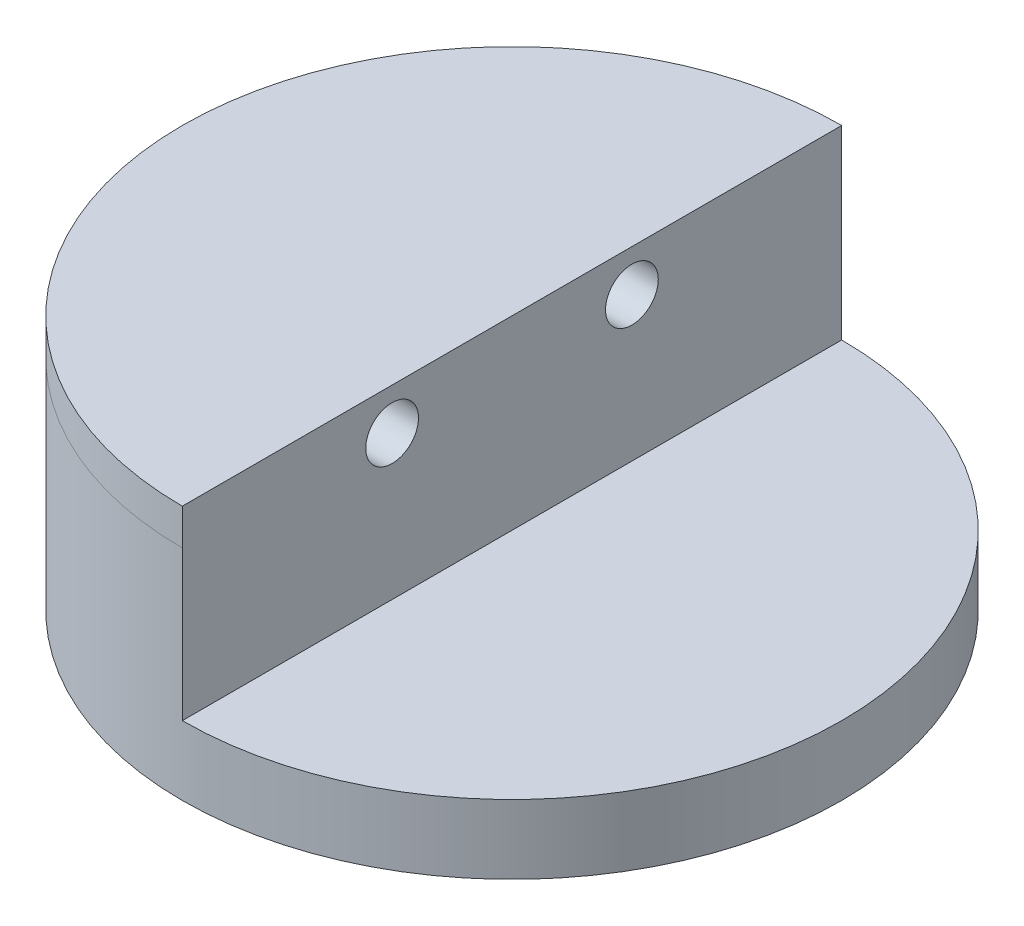
ISO-10303-21;
HEADER;
FILE_DESCRIPTION(('STEP AP214'),'2;1');
FILE_NAME('part.step','',(''),(''),'','','');
FILE_SCHEMA(('AUTOMOTIVE_DESIGN { 1 0 10303 214 1 1 1 1 }'));
ENDSEC;
DATA;
#1=APPLICATION_CONTEXT('core data for automotive mechanical design processes');
#2=APPLICATION_PROTOCOL_DEFINITION('international standard','automotive_design',2000,#1);
#3=PRODUCT_CONTEXT('',#1,'mechanical');
#4=PRODUCT('Part','Part','',(#3));
#5=PRODUCT_RELATED_PRODUCT_CATEGORY('part','',(#4));
#6=PRODUCT_DEFINITION_FORMATION('','',#4);
#7=PRODUCT_DEFINITION_CONTEXT('part definition',#1,'design');
#8=PRODUCT_DEFINITION('design','',#6,#7);
#9=PRODUCT_DEFINITION_SHAPE('','',#8);
#10=(LENGTH_UNIT() NAMED_UNIT(*) SI_UNIT(.MILLI.,.METRE.));
#11=(NAMED_UNIT(*) PLANE_ANGLE_UNIT() SI_UNIT($,.RADIAN.));
#12=(NAMED_UNIT(*) SI_UNIT($,.STERADIAN.) SOLID_ANGLE_UNIT());
#13=UNCERTAINTY_MEASURE_WITH_UNIT(LENGTH_MEASURE(1.E-05),#10,'distance_accuracy_value','');
#14=(GEOMETRIC_REPRESENTATION_CONTEXT(3) GLOBAL_UNCERTAINTY_ASSIGNED_CONTEXT((#13)) GLOBAL_UNIT_ASSIGNED_CONTEXT((#10,
#11,#12)) REPRESENTATION_CONTEXT('',''));
#15=CARTESIAN_POINT('',(0.,0.,0.));
#16=DIRECTION('',(0.,0.,1.));
#17=DIRECTION('',(1.,0.,0.));
#18=AXIS2_PLACEMENT_3D('',#15,#16,#17);
#19=CARTESIAN_POINT('',(0.,35.,0.));
#20=DIRECTION('',(0.,-1.,0.));
#21=DIRECTION('',(0.,0.,-1.));
#22=AXIS2_PLACEMENT_3D('',#19,#20,#21);
#23=CYLINDRICAL_SURFACE('',#22,55.);
#24=CARTESIAN_POINT('',(0.,0.,0.));
#25=DIRECTION('',(0.,1.,0.));
#26=DIRECTION('',(0.,0.,1.));
#27=AXIS2_PLACEMENT_3D('',#24,#25,#26);
#28=CIRCLE('',#27,55.);
#29=CARTESIAN_POINT('',(0.,0.,55.));
#30=VERTEX_POINT('',#29);
#31=EDGE_CURVE('E133',#30,#30,#28,.T.);
#32=ORIENTED_EDGE('',*,*,#31,.T.);
#33=EDGE_LOOP('',(#32));
#34=FACE_BOUND('',#33,.T.);
#35=DIRECTION('',(0.,-1.,0.));
#36=VECTOR('',#35,1.);
#37=CARTESIAN_POINT('',(0.,42.5292929936542,55.));
#38=LINE('',#37,#36);
#39=CARTESIAN_POINT('',(0.,36.497177088495,55.));
#40=VERTEX_POINT('',#39);
#41=CARTESIAN_POINT('',(0.,11.5375695683537,55.));
#42=VERTEX_POINT('',#41);
#43=EDGE_CURVE('E109',#40,#42,#38,.T.);
#44=ORIENTED_EDGE('',*,*,#43,.F.);
#45=CARTESIAN_POINT('',(0.,36.497177088495,0.));
#46=DIRECTION('',(0.,1.,0.));
#47=DIRECTION('',(0.,0.,1.));
#48=AXIS2_PLACEMENT_3D('',#45,#46,#47);
#49=CIRCLE('',#48,55.);
#50=CARTESIAN_POINT('',(0.,36.497177088495,-55.));
#51=VERTEX_POINT('',#50);
#52=EDGE_CURVE('E120',#51,#40,#49,.T.);
#53=ORIENTED_EDGE('',*,*,#52,.F.);
#54=DIRECTION('',(0.,1.,0.));
#55=VECTOR('',#54,1.);
#56=CARTESIAN_POINT('',(0.,42.5292929936542,-55.));
#57=LINE('',#56,#55);
#58=CARTESIAN_POINT('',(0.,11.5375695683537,-55.));
#59=VERTEX_POINT('',#58);
#60=EDGE_CURVE('E67',#59,#51,#57,.T.);
#61=ORIENTED_EDGE('',*,*,#60,.F.);
#62=CARTESIAN_POINT('',(0.,11.5375695683537,0.));
#63=DIRECTION('',(0.,1.,0.));
#64=DIRECTION('',(0.,0.,1.));
#65=AXIS2_PLACEMENT_3D('',#62,#63,#64);
#66=CIRCLE('',#65,55.);
#67=EDGE_CURVE('E11',#42,#59,#66,.T.);
#68=ORIENTED_EDGE('',*,*,#67,.F.);
#69=EDGE_LOOP('',(#44,#53,#61,#68));
#70=FACE_BOUND('',#69,.T.);
#71=ADVANCED_FACE('F46',(#34,#70),#23,.T.);
#72=CARTESIAN_POINT('',(0.,42.5292929936542,0.));
#73=DIRECTION('',(0.,1.,0.));
#74=DIRECTION('',(0.,0.,1.));
#75=AXIS2_PLACEMENT_3D('',#72,#73,#74);
#76=PLANE('',#75);
#77=CARTESIAN_POINT('',(0.,42.5292929936542,0.));
#78=DIRECTION('',(0.,1.,0.));
#79=DIRECTION('',(0.,0.,1.));
#80=AXIS2_PLACEMENT_3D('',#77,#78,#79);
#81=CIRCLE('',#80,55.);
#82=CARTESIAN_POINT('',(0.,42.5292929936542,-55.));
#83=VERTEX_POINT('',#82);
#84=CARTESIAN_POINT('',(0.,42.5292929936542,55.));
#85=VERTEX_POINT('',#84);
#86=EDGE_CURVE('E124',#83,#85,#81,.T.);
#87=ORIENTED_EDGE('',*,*,#86,.T.);
#88=DIRECTION('',(0.,0.,1.));
#89=VECTOR('',#88,1.);
#90=CARTESIAN_POINT('',(0.,42.5292929936542,55.));
#91=LINE('',#90,#89);
#92=EDGE_CURVE('E61',#83,#85,#91,.T.);
#93=ORIENTED_EDGE('',*,*,#92,.F.);
#94=EDGE_LOOP('',(#87,#93));
#95=FACE_BOUND('',#94,.T.);
#96=ADVANCED_FACE('F168',(#95),#76,.T.);
#97=CARTESIAN_POINT('',(0.,36.497177088495,0.));
#98=DIRECTION('',(0.,1.,0.));
#99=DIRECTION('',(0.,0.,1.));
#100=AXIS2_PLACEMENT_3D('',#97,#98,#99);
#101=CYLINDRICAL_SURFACE('',#100,55.);
#102=ORIENTED_EDGE('',*,*,#86,.F.);
#103=DIRECTION('',(0.,1.,0.));
#104=VECTOR('',#103,1.);
#105=CARTESIAN_POINT('',(0.,36.497177088495,-55.));
#106=LINE('',#105,#104);
#107=EDGE_CURVE('E54',#83,#51,#106,.F.);
#108=ORIENTED_EDGE('',*,*,#107,.T.);
#109=ORIENTED_EDGE('',*,*,#52,.T.);
#110=EDGE_CURVE('E110',#85,#40,#38,.T.);
#111=ORIENTED_EDGE('',*,*,#110,.F.);
#112=EDGE_LOOP('',(#102,#108,#109,#111));
#113=FACE_BOUND('',#112,.T.);
#114=ADVANCED_FACE('F143',(#113),#101,.T.);
#115=CARTESIAN_POINT('',(0.,0.,0.));
#116=DIRECTION('',(0.,1.,0.));
#117=DIRECTION('',(0.,0.,1.));
#118=AXIS2_PLACEMENT_3D('',#115,#116,#117);
#119=PLANE('',#118);
#120=CARTESIAN_POINT('',(0.,0.,0.));
#121=DIRECTION('',(0.,-1.,0.));
#122=DIRECTION('',(0.,0.,-1.));
#123=AXIS2_PLACEMENT_3D('',#120,#121,#122);
#124=CIRCLE('',#123,28.);
#125=CARTESIAN_POINT('',(0.,0.,-28.));
#126=VERTEX_POINT('',#125);
#127=EDGE_CURVE('E128',#126,#126,#124,.T.);
#128=ORIENTED_EDGE('',*,*,#127,.F.);
#129=EDGE_LOOP('',(#128));
#130=FACE_BOUND('',#129,.T.);
#131=ORIENTED_EDGE('',*,*,#31,.F.);
#132=EDGE_LOOP('',(#131));
#133=FACE_BOUND('',#132,.T.);
#134=ADVANCED_FACE('F177',(#130,#133),#119,.F.);
#135=CARTESIAN_POINT('',(0.,10.,0.));
#136=DIRECTION('',(0.,-1.,0.));
#137=DIRECTION('',(0.,0.,-1.));
#138=AXIS2_PLACEMENT_3D('',#135,#136,#137);
#139=CYLINDRICAL_SURFACE('',#138,28.);
#140=CARTESIAN_POINT('',(0.,10.,0.));
#141=DIRECTION('',(0.,-1.,0.));
#142=DIRECTION('',(0.,0.,-1.));
#143=AXIS2_PLACEMENT_3D('',#140,#141,#142);
#144=CIRCLE('',#143,28.);
#145=CARTESIAN_POINT('',(0.,10.,-28.));
#146=VERTEX_POINT('',#145);
#147=EDGE_CURVE('E129',#146,#146,#144,.T.);
#148=ORIENTED_EDGE('',*,*,#147,.F.);
#149=EDGE_LOOP('',(#148));
#150=FACE_BOUND('',#149,.T.);
#151=ORIENTED_EDGE('',*,*,#127,.T.);
#152=EDGE_LOOP('',(#151));
#153=FACE_BOUND('',#152,.T.);
#154=ADVANCED_FACE('F163',(#150,#153),#139,.F.);
#155=CARTESIAN_POINT('',(0.,10.,0.));
#156=DIRECTION('',(0.,-1.,0.));
#157=DIRECTION('',(0.,0.,-1.));
#158=AXIS2_PLACEMENT_3D('',#155,#156,#157);
#159=PLANE('',#158);
#160=ORIENTED_EDGE('',*,*,#147,.T.);
#161=EDGE_LOOP('',(#160));
#162=FACE_BOUND('',#161,.T.);
#163=ADVANCED_FACE('F153',(#162),#159,.T.);
#164=CARTESIAN_POINT('',(70.,11.5375695683537,55.));
#165=DIRECTION('',(0.,1.,0.));
#166=DIRECTION('',(0.,0.,1.));
#167=AXIS2_PLACEMENT_3D('',#164,#165,#166);
#168=PLANE('',#167);
#169=ORIENTED_EDGE('',*,*,#67,.T.);
#170=DIRECTION('',(0.,0.,-1.));
#171=VECTOR('',#170,1.);
#172=CARTESIAN_POINT('',(0.,11.5375695683537,55.));
#173=LINE('',#172,#171);
#174=EDGE_CURVE('E113',#42,#59,#173,.T.);
#175=ORIENTED_EDGE('',*,*,#174,.F.);
#176=EDGE_LOOP('',(#169,#175));
#177=FACE_BOUND('',#176,.T.);
#178=ADVANCED_FACE('F151',(#177),#168,.T.);
#179=CARTESIAN_POINT('',(0.,0.,0.));
#180=DIRECTION('',(1.,0.,0.));
#181=DIRECTION('',(0.,0.,-1.));
#182=AXIS2_PLACEMENT_3D('',#179,#180,#181);
#183=PLANE('',#182);
#184=CARTESIAN_POINT('',(0.,35.5892929936542,20.));
#185=DIRECTION('',(1.,0.,0.));
#186=DIRECTION('',(0.,0.,-1.));
#187=AXIS2_PLACEMENT_3D('',#184,#185,#186);
#188=CIRCLE('',#187,4.39999999999999);
#189=CARTESIAN_POINT('',(0.,35.5892929936542,15.6));
#190=VERTEX_POINT('',#189);
#191=EDGE_CURVE('E96',#190,#190,#188,.T.);
#192=ORIENTED_EDGE('',*,*,#191,.F.);
#193=EDGE_LOOP('',(#192));
#194=FACE_BOUND('',#193,.T.);
#195=CARTESIAN_POINT('',(0.,35.5892929936542,-20.));
#196=DIRECTION('',(1.,0.,0.));
#197=DIRECTION('',(0.,0.,-1.));
#198=AXIS2_PLACEMENT_3D('',#195,#196,#197);
#199=CIRCLE('',#198,4.39999999999999);
#200=CARTESIAN_POINT('',(0.,35.5892929936542,-24.4));
#201=VERTEX_POINT('',#200);
#202=EDGE_CURVE('E95',#201,#201,#199,.T.);
#203=ORIENTED_EDGE('',*,*,#202,.F.);
#204=EDGE_LOOP('',(#203));
#205=FACE_BOUND('',#204,.T.);
#206=ORIENTED_EDGE('',*,*,#110,.T.);
#207=ORIENTED_EDGE('',*,*,#43,.T.);
#208=ORIENTED_EDGE('',*,*,#174,.T.);
#209=ORIENTED_EDGE('',*,*,#60,.T.);
#210=ORIENTED_EDGE('',*,*,#107,.F.);
#211=ORIENTED_EDGE('',*,*,#92,.T.);
#212=EDGE_LOOP('',(#206,#207,#208,#209,#210,#211));
#213=FACE_BOUND('',#212,.T.);
#214=ADVANCED_FACE('F149',(#194,#205,#213),#183,.T.);
#215=CARTESIAN_POINT('',(-26.25,35.5892929936542,-20.));
#216=DIRECTION('',(1.,0.,0.));
#217=DIRECTION('',(0.,0.,-1.));
#218=AXIS2_PLACEMENT_3D('',#215,#216,#217);
#219=CONICAL_SURFACE('',#218,4.39999999999999,1.02974425867665);
#220=CARTESIAN_POINT('',(-28.8937867237213,35.5892929936542,-20.));
#221=VERTEX_POINT('',#220);
#222=VERTEX_LOOP('',#221);
#223=FACE_BOUND('',#222,.T.);
#224=CARTESIAN_POINT('',(-26.25,35.5892929936542,-20.));
#225=DIRECTION('',(1.,0.,0.));
#226=DIRECTION('',(0.,0.,-1.));
#227=AXIS2_PLACEMENT_3D('',#224,#225,#226);
#228=CIRCLE('',#227,4.39999999999999);
#229=CARTESIAN_POINT('',(-26.25,35.5892929936542,-24.4));
#230=VERTEX_POINT('',#229);
#231=EDGE_CURVE('E101',#230,#230,#228,.T.);
#232=ORIENTED_EDGE('',*,*,#231,.T.);
#233=EDGE_LOOP('',(#232));
#234=FACE_BOUND('',#233,.T.);
#235=ADVANCED_FACE('F160',(#223,#234),#219,.F.);
#236=CARTESIAN_POINT('',(0.,35.5892929936542,-20.));
#237=DIRECTION('',(1.,0.,0.));
#238=DIRECTION('',(0.,0.,-1.));
#239=AXIS2_PLACEMENT_3D('',#236,#237,#238);
#240=CYLINDRICAL_SURFACE('',#239,4.39999999999999);
#241=ORIENTED_EDGE('',*,*,#231,.F.);
#242=EDGE_LOOP('',(#241));
#243=FACE_BOUND('',#242,.T.);
#244=ORIENTED_EDGE('',*,*,#202,.T.);
#245=EDGE_LOOP('',(#244));
#246=FACE_BOUND('',#245,.T.);
#247=ADVANCED_FACE('F88',(#243,#246),#240,.F.);
#248=CARTESIAN_POINT('',(-26.25,35.5892929936542,20.));
#249=DIRECTION('',(1.,0.,0.));
#250=DIRECTION('',(0.,0.,-1.));
#251=AXIS2_PLACEMENT_3D('',#248,#249,#250);
#252=CONICAL_SURFACE('',#251,4.39999999999999,1.02974425867665);
#253=CARTESIAN_POINT('',(-28.8937867237213,35.5892929936542,20.));
#254=VERTEX_POINT('',#253);
#255=VERTEX_LOOP('',#254);
#256=FACE_BOUND('',#255,.T.);
#257=CARTESIAN_POINT('',(-26.25,35.5892929936542,20.));
#258=DIRECTION('',(1.,0.,0.));
#259=DIRECTION('',(0.,0.,-1.));
#260=AXIS2_PLACEMENT_3D('',#257,#258,#259);
#261=CIRCLE('',#260,4.39999999999999);
#262=CARTESIAN_POINT('',(-26.25,35.5892929936542,15.6));
#263=VERTEX_POINT('',#262);
#264=EDGE_CURVE('E92',#263,#263,#261,.T.);
#265=ORIENTED_EDGE('',*,*,#264,.T.);
#266=EDGE_LOOP('',(#265));
#267=FACE_BOUND('',#266,.T.);
#268=ADVANCED_FACE('F84',(#256,#267),#252,.F.);
#269=CARTESIAN_POINT('',(0.,35.5892929936542,20.));
#270=DIRECTION('',(1.,0.,0.));
#271=DIRECTION('',(0.,0.,-1.));
#272=AXIS2_PLACEMENT_3D('',#269,#270,#271);
#273=CYLINDRICAL_SURFACE('',#272,4.39999999999999);
#274=ORIENTED_EDGE('',*,*,#264,.F.);
#275=EDGE_LOOP('',(#274));
#276=FACE_BOUND('',#275,.T.);
#277=ORIENTED_EDGE('',*,*,#191,.T.);
#278=EDGE_LOOP('',(#277));
#279=FACE_BOUND('',#278,.T.);
#280=ADVANCED_FACE('F87',(#276,#279),#273,.F.);
#281=CLOSED_SHELL('',(#71,#96,#114,#134,#154,#163,#178,#214,#235,#247,#268,#280));
#282=MANIFOLD_SOLID_BREP('B2',#281);
#283=ADVANCED_BREP_SHAPE_REPRESENTATION('',(#18,#282),#14);
#284=SHAPE_DEFINITION_REPRESENTATION(#9,#283);
ENDSEC;
END-ISO-10303-21;
